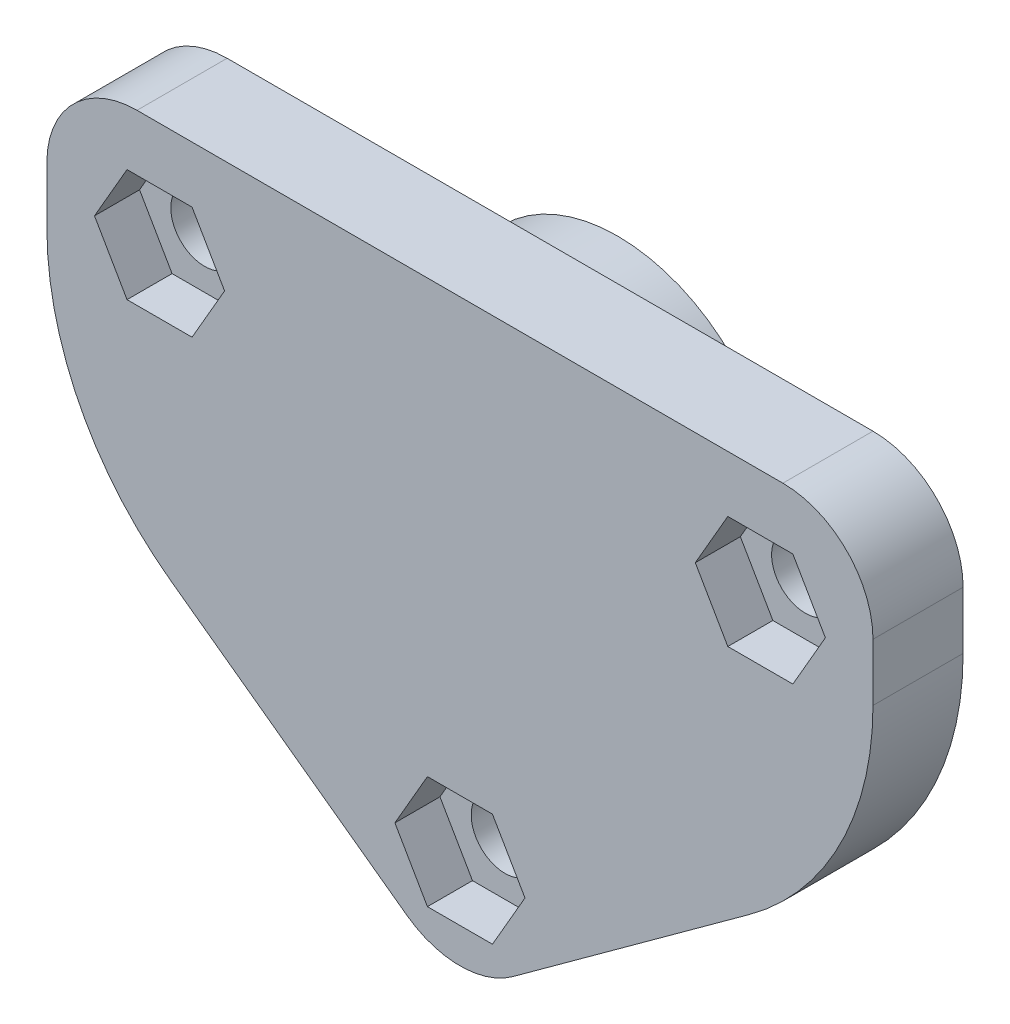
ISO-10303-21;
HEADER;
FILE_DESCRIPTION(('STEP AP214'),'2;1');
FILE_NAME('part.step','',(''),(''),'','','');
FILE_SCHEMA(('AUTOMOTIVE_DESIGN { 1 0 10303 214 1 1 1 1 }'));
ENDSEC;
DATA;
#1=APPLICATION_CONTEXT('core data for automotive mechanical design processes');
#2=APPLICATION_PROTOCOL_DEFINITION('international standard','automotive_design',2000,#1);
#3=PRODUCT_CONTEXT('',#1,'mechanical');
#4=PRODUCT('Part','Part','',(#3));
#5=PRODUCT_RELATED_PRODUCT_CATEGORY('part','',(#4));
#6=PRODUCT_DEFINITION_FORMATION('','',#4);
#7=PRODUCT_DEFINITION_CONTEXT('part definition',#1,'design');
#8=PRODUCT_DEFINITION('design','',#6,#7);
#9=PRODUCT_DEFINITION_SHAPE('','',#8);
#10=(LENGTH_UNIT() NAMED_UNIT(*) SI_UNIT(.MILLI.,.METRE.));
#11=(NAMED_UNIT(*) PLANE_ANGLE_UNIT() SI_UNIT($,.RADIAN.));
#12=(NAMED_UNIT(*) SI_UNIT($,.STERADIAN.) SOLID_ANGLE_UNIT());
#13=UNCERTAINTY_MEASURE_WITH_UNIT(LENGTH_MEASURE(1.E-05),#10,'distance_accuracy_value','');
#14=(GEOMETRIC_REPRESENTATION_CONTEXT(3) GLOBAL_UNCERTAINTY_ASSIGNED_CONTEXT((#13)) GLOBAL_UNIT_ASSIGNED_CONTEXT((#10,
#11,#12)) REPRESENTATION_CONTEXT('',''));
#15=CARTESIAN_POINT('',(0.,0.,0.));
#16=DIRECTION('',(0.,0.,1.));
#17=DIRECTION('',(1.,0.,0.));
#18=AXIS2_PLACEMENT_3D('',#15,#16,#17);
#19=CARTESIAN_POINT('',(-27.5,7.5,6.));
#20=DIRECTION('',(0.,0.,-1.));
#21=DIRECTION('',(-1.,0.,0.));
#22=AXIS2_PLACEMENT_3D('',#19,#20,#21);
#23=CYLINDRICAL_SURFACE('',#22,2.25);
#24=CARTESIAN_POINT('',(-27.5,7.5,0.));
#25=DIRECTION('',(0.,0.,1.));
#26=DIRECTION('',(1.,0.,0.));
#27=AXIS2_PLACEMENT_3D('',#24,#25,#26);
#28=CIRCLE('',#27,2.25);
#29=CARTESIAN_POINT('',(-25.25,7.5,0.));
#30=VERTEX_POINT('',#29);
#31=EDGE_CURVE('E373',#30,#30,#28,.T.);
#32=ORIENTED_EDGE('',*,*,#31,.F.);
#33=EDGE_LOOP('',(#32));
#34=FACE_BOUND('',#33,.T.);
#35=CARTESIAN_POINT('',(-27.5,7.5,3.));
#36=DIRECTION('',(0.,0.,1.));
#37=DIRECTION('',(1.,0.,0.));
#38=AXIS2_PLACEMENT_3D('',#35,#36,#37);
#39=CIRCLE('',#38,2.25);
#40=CARTESIAN_POINT('',(-25.25,7.5,3.));
#41=VERTEX_POINT('',#40);
#42=EDGE_CURVE('E37',#41,#41,#39,.T.);
#43=ORIENTED_EDGE('',*,*,#42,.T.);
#44=EDGE_LOOP('',(#43));
#45=FACE_BOUND('',#44,.T.);
#46=ADVANCED_FACE('F33',(#34,#45),#23,.F.);
#47=CARTESIAN_POINT('',(-7.5,32.5,6.));
#48=DIRECTION('',(0.,0.,-1.));
#49=DIRECTION('',(-1.,0.,0.));
#50=AXIS2_PLACEMENT_3D('',#47,#48,#49);
#51=CYLINDRICAL_SURFACE('',#50,2.25);
#52=CARTESIAN_POINT('',(-7.5,32.5,0.));
#53=DIRECTION('',(0.,0.,1.));
#54=DIRECTION('',(1.,0.,0.));
#55=AXIS2_PLACEMENT_3D('',#52,#53,#54);
#56=CIRCLE('',#55,2.25);
#57=CARTESIAN_POINT('',(-5.25,32.5,0.));
#58=VERTEX_POINT('',#57);
#59=EDGE_CURVE('E377',#58,#58,#56,.T.);
#60=ORIENTED_EDGE('',*,*,#59,.F.);
#61=EDGE_LOOP('',(#60));
#62=FACE_BOUND('',#61,.T.);
#63=CARTESIAN_POINT('',(-7.5,32.5,3.));
#64=DIRECTION('',(0.,0.,1.));
#65=DIRECTION('',(1.,0.,0.));
#66=AXIS2_PLACEMENT_3D('',#63,#64,#65);
#67=CIRCLE('',#66,2.25);
#68=CARTESIAN_POINT('',(-5.25,32.5,3.));
#69=VERTEX_POINT('',#68);
#70=EDGE_CURVE('E311',#69,#69,#67,.T.);
#71=ORIENTED_EDGE('',*,*,#70,.T.);
#72=EDGE_LOOP('',(#71));
#73=FACE_BOUND('',#72,.T.);
#74=ADVANCED_FACE('F463',(#62,#73),#51,.F.);
#75=CARTESIAN_POINT('',(-47.5,32.5,6.));
#76=DIRECTION('',(0.,0.,-1.));
#77=DIRECTION('',(-1.,0.,0.));
#78=AXIS2_PLACEMENT_3D('',#75,#76,#77);
#79=CYLINDRICAL_SURFACE('',#78,2.25);
#80=CARTESIAN_POINT('',(-47.5,32.5,0.));
#81=DIRECTION('',(0.,0.,1.));
#82=DIRECTION('',(1.,0.,0.));
#83=AXIS2_PLACEMENT_3D('',#80,#81,#82);
#84=CIRCLE('',#83,2.25);
#85=CARTESIAN_POINT('',(-45.25,32.5,0.));
#86=VERTEX_POINT('',#85);
#87=EDGE_CURVE('E380',#86,#86,#84,.T.);
#88=ORIENTED_EDGE('',*,*,#87,.F.);
#89=EDGE_LOOP('',(#88));
#90=FACE_BOUND('',#89,.T.);
#91=CARTESIAN_POINT('',(-47.5,32.5,3.));
#92=DIRECTION('',(0.,0.,1.));
#93=DIRECTION('',(1.,0.,0.));
#94=AXIS2_PLACEMENT_3D('',#91,#92,#93);
#95=CIRCLE('',#94,2.25);
#96=CARTESIAN_POINT('',(-45.25,32.5,3.));
#97=VERTEX_POINT('',#96);
#98=EDGE_CURVE('E359',#97,#97,#95,.T.);
#99=ORIENTED_EDGE('',*,*,#98,.T.);
#100=EDGE_LOOP('',(#99));
#101=FACE_BOUND('',#100,.T.);
#102=ADVANCED_FACE('F496',(#90,#101),#79,.F.);
#103=CARTESIAN_POINT('',(0.,0.,6.));
#104=DIRECTION('',(0.,0.,1.));
#105=DIRECTION('',(1.,0.,0.));
#106=AXIS2_PLACEMENT_3D('',#103,#104,#105);
#107=PLANE('',#106);
#108=DIRECTION('',(0.5,0.866025403784439,0.));
#109=VECTOR('',#108,1.);
#110=CARTESIAN_POINT('',(-25.3349364905389,3.75,6.));
#111=LINE('',#110,#109);
#112=CARTESIAN_POINT('',(-25.3349364905389,3.75,6.));
#113=VERTEX_POINT('',#112);
#114=CARTESIAN_POINT('',(-23.1698729810778,7.5,6.));
#115=VERTEX_POINT('',#114);
#116=EDGE_CURVE('E50',#113,#115,#111,.T.);
#117=ORIENTED_EDGE('',*,*,#116,.F.);
#118=DIRECTION('',(1.,0.,0.));
#119=VECTOR('',#118,1.);
#120=CARTESIAN_POINT('',(-29.6650635094611,3.75,6.));
#121=LINE('',#120,#119);
#122=CARTESIAN_POINT('',(-29.6650635094611,3.75,6.));
#123=VERTEX_POINT('',#122);
#124=EDGE_CURVE('E241',#123,#113,#121,.T.);
#125=ORIENTED_EDGE('',*,*,#124,.F.);
#126=DIRECTION('',(0.5,-0.866025403784438,0.));
#127=VECTOR('',#126,1.);
#128=CARTESIAN_POINT('',(-31.8301270189222,7.5,6.));
#129=LINE('',#128,#127);
#130=CARTESIAN_POINT('',(-31.8301270189222,7.5,6.));
#131=VERTEX_POINT('',#130);
#132=EDGE_CURVE('E244',#131,#123,#129,.T.);
#133=ORIENTED_EDGE('',*,*,#132,.F.);
#134=DIRECTION('',(-0.5,-0.866025403784438,0.));
#135=VECTOR('',#134,1.);
#136=CARTESIAN_POINT('',(-29.6650635094611,11.25,6.));
#137=LINE('',#136,#135);
#138=CARTESIAN_POINT('',(-29.6650635094611,11.25,6.));
#139=VERTEX_POINT('',#138);
#140=EDGE_CURVE('E260',#139,#131,#137,.T.);
#141=ORIENTED_EDGE('',*,*,#140,.F.);
#142=DIRECTION('',(-1.,0.,0.));
#143=VECTOR('',#142,1.);
#144=CARTESIAN_POINT('',(-25.3349364905389,11.25,6.));
#145=LINE('',#144,#143);
#146=CARTESIAN_POINT('',(-25.3349364905389,11.25,6.));
#147=VERTEX_POINT('',#146);
#148=EDGE_CURVE('E257',#147,#139,#145,.T.);
#149=ORIENTED_EDGE('',*,*,#148,.F.);
#150=DIRECTION('',(-0.5,0.866025403784439,0.));
#151=VECTOR('',#150,1.);
#152=CARTESIAN_POINT('',(-23.1698729810778,7.5,6.));
#153=LINE('',#152,#151);
#154=EDGE_CURVE('E255',#115,#147,#153,.T.);
#155=ORIENTED_EDGE('',*,*,#154,.F.);
#156=EDGE_LOOP('',(#117,#125,#133,#141,#149,#155));
#157=FACE_BOUND('',#156,.T.);
#158=DIRECTION('',(-0.5,-0.866025403784439,0.));
#159=VECTOR('',#158,1.);
#160=CARTESIAN_POINT('',(-9.6650635094611,36.25,6.));
#161=LINE('',#160,#159);
#162=CARTESIAN_POINT('',(-9.6650635094611,36.25,6.));
#163=VERTEX_POINT('',#162);
#164=CARTESIAN_POINT('',(-11.8301270189222,32.5,6.));
#165=VERTEX_POINT('',#164);
#166=EDGE_CURVE('E58',#163,#165,#161,.T.);
#167=ORIENTED_EDGE('',*,*,#166,.F.);
#168=DIRECTION('',(-1.,0.,0.));
#169=VECTOR('',#168,1.);
#170=CARTESIAN_POINT('',(-5.3349364905389,36.25,6.));
#171=LINE('',#170,#169);
#172=CARTESIAN_POINT('',(-5.3349364905389,36.25,6.));
#173=VERTEX_POINT('',#172);
#174=EDGE_CURVE('E278',#173,#163,#171,.T.);
#175=ORIENTED_EDGE('',*,*,#174,.F.);
#176=DIRECTION('',(-0.5,0.866025403784439,0.));
#177=VECTOR('',#176,1.);
#178=CARTESIAN_POINT('',(-3.16987298107781,32.5,6.));
#179=LINE('',#178,#177);
#180=CARTESIAN_POINT('',(-3.16987298107781,32.5,6.));
#181=VERTEX_POINT('',#180);
#182=EDGE_CURVE('E304',#181,#173,#179,.T.);
#183=ORIENTED_EDGE('',*,*,#182,.F.);
#184=DIRECTION('',(0.5,0.866025403784438,0.));
#185=VECTOR('',#184,1.);
#186=CARTESIAN_POINT('',(-5.33493649053891,28.75,6.));
#187=LINE('',#186,#185);
#188=CARTESIAN_POINT('',(-5.33493649053891,28.75,6.));
#189=VERTEX_POINT('',#188);
#190=EDGE_CURVE('E301',#189,#181,#187,.T.);
#191=ORIENTED_EDGE('',*,*,#190,.F.);
#192=DIRECTION('',(1.,0.,0.));
#193=VECTOR('',#192,1.);
#194=CARTESIAN_POINT('',(-9.6650635094611,28.75,6.));
#195=LINE('',#194,#193);
#196=CARTESIAN_POINT('',(-9.6650635094611,28.75,6.));
#197=VERTEX_POINT('',#196);
#198=EDGE_CURVE('E298',#197,#189,#195,.T.);
#199=ORIENTED_EDGE('',*,*,#198,.F.);
#200=DIRECTION('',(0.5,-0.866025403784439,0.));
#201=VECTOR('',#200,1.);
#202=CARTESIAN_POINT('',(-11.8301270189222,32.5,6.));
#203=LINE('',#202,#201);
#204=EDGE_CURVE('E295',#165,#197,#203,.T.);
#205=ORIENTED_EDGE('',*,*,#204,.F.);
#206=EDGE_LOOP('',(#167,#175,#183,#191,#199,#205));
#207=FACE_BOUND('',#206,.T.);
#208=DIRECTION('',(0.5,0.866025403784439,0.));
#209=VECTOR('',#208,1.);
#210=CARTESIAN_POINT('',(-45.3349364905389,28.75,6.));
#211=LINE('',#210,#209);
#212=CARTESIAN_POINT('',(-45.3349364905389,28.75,6.));
#213=VERTEX_POINT('',#212);
#214=CARTESIAN_POINT('',(-43.1698729810778,32.5,6.));
#215=VERTEX_POINT('',#214);
#216=EDGE_CURVE('E341',#213,#215,#211,.T.);
#217=ORIENTED_EDGE('',*,*,#216,.F.);
#218=DIRECTION('',(1.,0.,0.));
#219=VECTOR('',#218,1.);
#220=CARTESIAN_POINT('',(-49.6650635094611,28.75,6.));
#221=LINE('',#220,#219);
#222=CARTESIAN_POINT('',(-49.6650635094611,28.75,6.));
#223=VERTEX_POINT('',#222);
#224=EDGE_CURVE('E325',#223,#213,#221,.T.);
#225=ORIENTED_EDGE('',*,*,#224,.F.);
#226=DIRECTION('',(0.5,-0.866025403784439,0.));
#227=VECTOR('',#226,1.);
#228=CARTESIAN_POINT('',(-51.8301270189222,32.5,6.));
#229=LINE('',#228,#227);
#230=CARTESIAN_POINT('',(-51.8301270189222,32.5,6.));
#231=VERTEX_POINT('',#230);
#232=EDGE_CURVE('E352',#231,#223,#229,.T.);
#233=ORIENTED_EDGE('',*,*,#232,.F.);
#234=DIRECTION('',(-0.500000000000001,-0.866025403784438,0.));
#235=VECTOR('',#234,1.);
#236=CARTESIAN_POINT('',(-49.6650635094611,36.25,6.));
#237=LINE('',#236,#235);
#238=CARTESIAN_POINT('',(-49.6650635094611,36.25,6.));
#239=VERTEX_POINT('',#238);
#240=EDGE_CURVE('E349',#239,#231,#237,.T.);
#241=ORIENTED_EDGE('',*,*,#240,.F.);
#242=DIRECTION('',(-1.,0.,0.));
#243=VECTOR('',#242,1.);
#244=CARTESIAN_POINT('',(-45.3349364905389,36.25,6.));
#245=LINE('',#244,#243);
#246=CARTESIAN_POINT('',(-45.3349364905389,36.25,6.));
#247=VERTEX_POINT('',#246);
#248=EDGE_CURVE('E346',#247,#239,#245,.T.);
#249=ORIENTED_EDGE('',*,*,#248,.F.);
#250=DIRECTION('',(-0.5,0.866025403784439,0.));
#251=VECTOR('',#250,1.);
#252=CARTESIAN_POINT('',(-43.1698729810778,32.5,6.));
#253=LINE('',#252,#251);
#254=EDGE_CURVE('E343',#215,#247,#253,.T.);
#255=ORIENTED_EDGE('',*,*,#254,.F.);
#256=EDGE_LOOP('',(#217,#225,#233,#241,#249,#255));
#257=FACE_BOUND('',#256,.T.);
#258=DIRECTION('',(0.,-1.,0.));
#259=VECTOR('',#258,1.);
#260=CARTESIAN_POINT('',(-55.,40.,6.));
#261=LINE('',#260,#259);
#262=CARTESIAN_POINT('',(-55.,34.,6.));
#263=VERTEX_POINT('',#262);
#264=CARTESIAN_POINT('',(-55.,30.1844918340644,6.));
#265=VERTEX_POINT('',#264);
#266=EDGE_CURVE('E384',#263,#265,#261,.T.);
#267=ORIENTED_EDGE('',*,*,#266,.T.);
#268=CARTESIAN_POINT('',(-35.,30.1844918340644,6.));
#269=DIRECTION('',(0.,0.,1.));
#270=DIRECTION('',(1.,0.,0.));
#271=AXIS2_PLACEMENT_3D('',#268,#269,#270);
#272=CIRCLE('',#271,20.);
#273=CARTESIAN_POINT('',(-46.7634339535009,14.0097701480007,6.));
#274=VERTEX_POINT('',#273);
#275=EDGE_CURVE('E451',#265,#274,#272,.T.);
#276=ORIENTED_EDGE('',*,*,#275,.T.);
#277=DIRECTION('',(0.808736084303188,-0.588171697675046,0.));
#278=VECTOR('',#277,1.);
#279=CARTESIAN_POINT('',(-55.,20.,6.));
#280=LINE('',#279,#278);
#281=CARTESIAN_POINT('',(-31.0290301860503,2.56656740803657,6.));
#282=VERTEX_POINT('',#281);
#283=EDGE_CURVE('E387',#274,#282,#280,.T.);
#284=ORIENTED_EDGE('',*,*,#283,.T.);
#285=CARTESIAN_POINT('',(-27.5,7.4189839138557,6.));
#286=DIRECTION('',(0.,0.,1.));
#287=DIRECTION('',(1.,0.,0.));
#288=AXIS2_PLACEMENT_3D('',#285,#286,#287);
#289=CIRCLE('',#288,6.);
#290=CARTESIAN_POINT('',(-23.9709698139497,2.56656740803657,6.));
#291=VERTEX_POINT('',#290);
#292=EDGE_CURVE('E427',#282,#291,#289,.T.);
#293=ORIENTED_EDGE('',*,*,#292,.T.);
#294=DIRECTION('',(0.808736084303188,0.588171697675046,0.));
#295=VECTOR('',#294,1.);
#296=CARTESIAN_POINT('',(-27.5,0.,6.));
#297=LINE('',#296,#295);
#298=CARTESIAN_POINT('',(-8.23656604649908,14.0097701480007,6.));
#299=VERTEX_POINT('',#298);
#300=EDGE_CURVE('E390',#291,#299,#297,.T.);
#301=ORIENTED_EDGE('',*,*,#300,.T.);
#302=CARTESIAN_POINT('',(-20.,30.1844918340644,6.));
#303=DIRECTION('',(0.,0.,1.));
#304=DIRECTION('',(1.,0.,0.));
#305=AXIS2_PLACEMENT_3D('',#302,#303,#304);
#306=CIRCLE('',#305,20.);
#307=CARTESIAN_POINT('',(0.,30.1844918340644,6.));
#308=VERTEX_POINT('',#307);
#309=EDGE_CURVE('E449',#299,#308,#306,.T.);
#310=ORIENTED_EDGE('',*,*,#309,.T.);
#311=DIRECTION('',(0.,1.,0.));
#312=VECTOR('',#311,1.);
#313=CARTESIAN_POINT('',(0.,40.,6.));
#314=LINE('',#313,#312);
#315=CARTESIAN_POINT('',(0.,34.,6.));
#316=VERTEX_POINT('',#315);
#317=EDGE_CURVE('E393',#308,#316,#314,.T.);
#318=ORIENTED_EDGE('',*,*,#317,.T.);
#319=CARTESIAN_POINT('',(-6.,34.,6.));
#320=DIRECTION('',(0.,0.,1.));
#321=DIRECTION('',(1.,0.,0.));
#322=AXIS2_PLACEMENT_3D('',#319,#320,#321);
#323=CIRCLE('',#322,6.);
#324=CARTESIAN_POINT('',(-6.,40.,6.));
#325=VERTEX_POINT('',#324);
#326=EDGE_CURVE('E423',#316,#325,#323,.T.);
#327=ORIENTED_EDGE('',*,*,#326,.T.);
#328=DIRECTION('',(-1.,0.,0.));
#329=VECTOR('',#328,1.);
#330=CARTESIAN_POINT('',(-55.,40.,6.));
#331=LINE('',#330,#329);
#332=CARTESIAN_POINT('',(-49.,40.,6.));
#333=VERTEX_POINT('',#332);
#334=EDGE_CURVE('E395',#325,#333,#331,.T.);
#335=ORIENTED_EDGE('',*,*,#334,.T.);
#336=CARTESIAN_POINT('',(-49.,34.,6.));
#337=DIRECTION('',(0.,0.,1.));
#338=DIRECTION('',(1.,0.,0.));
#339=AXIS2_PLACEMENT_3D('',#336,#337,#338);
#340=CIRCLE('',#339,6.);
#341=EDGE_CURVE('E425',#333,#263,#340,.T.);
#342=ORIENTED_EDGE('',*,*,#341,.T.);
#343=EDGE_LOOP('',(#267,#276,#284,#293,#301,#310,#318,#327,#335,#342));
#344=FACE_BOUND('',#343,.T.);
#345=ADVANCED_FACE('F492',(#157,#207,#257,#344),#107,.T.);
#346=CARTESIAN_POINT('',(0.,0.,0.));
#347=DIRECTION('',(0.,0.,1.));
#348=DIRECTION('',(1.,0.,0.));
#349=AXIS2_PLACEMENT_3D('',#346,#347,#348);
#350=PLANE('',#349);
#351=CARTESIAN_POINT('',(-27.5,27.5,0.));
#352=DIRECTION('',(0.,0.,1.));
#353=DIRECTION('',(1.,0.,0.));
#354=AXIS2_PLACEMENT_3D('',#351,#352,#353);
#355=CIRCLE('',#354,10.75);
#356=CARTESIAN_POINT('',(-16.75,27.5,0.));
#357=VERTEX_POINT('',#356);
#358=EDGE_CURVE('E11',#357,#357,#355,.F.);
#359=ORIENTED_EDGE('',*,*,#358,.F.);
#360=EDGE_LOOP('',(#359));
#361=FACE_BOUND('',#360,.T.);
#362=DIRECTION('',(0.808736084303188,-0.588171697675046,0.));
#363=VECTOR('',#362,1.);
#364=CARTESIAN_POINT('',(-55.,20.,0.));
#365=LINE('',#364,#363);
#366=CARTESIAN_POINT('',(-46.7634339535009,14.0097701480007,0.));
#367=VERTEX_POINT('',#366);
#368=CARTESIAN_POINT('',(-31.0290301860503,2.56656740803657,0.));
#369=VERTEX_POINT('',#368);
#370=EDGE_CURVE('E401',#367,#369,#365,.T.);
#371=ORIENTED_EDGE('',*,*,#370,.F.);
#372=CARTESIAN_POINT('',(-35.,30.1844918340644,0.));
#373=DIRECTION('',(0.,0.,1.));
#374=DIRECTION('',(1.,0.,0.));
#375=AXIS2_PLACEMENT_3D('',#372,#373,#374);
#376=CIRCLE('',#375,20.);
#377=CARTESIAN_POINT('',(-55.,30.1844918340644,0.));
#378=VERTEX_POINT('',#377);
#379=EDGE_CURVE('E445',#367,#378,#376,.F.);
#380=ORIENTED_EDGE('',*,*,#379,.T.);
#381=DIRECTION('',(0.,-1.,0.));
#382=VECTOR('',#381,1.);
#383=CARTESIAN_POINT('',(-55.,40.,0.));
#384=LINE('',#383,#382);
#385=CARTESIAN_POINT('',(-55.,34.,0.));
#386=VERTEX_POINT('',#385);
#387=EDGE_CURVE('E383',#386,#378,#384,.T.);
#388=ORIENTED_EDGE('',*,*,#387,.F.);
#389=CARTESIAN_POINT('',(-49.,34.,0.));
#390=DIRECTION('',(0.,0.,1.));
#391=DIRECTION('',(1.,0.,0.));
#392=AXIS2_PLACEMENT_3D('',#389,#390,#391);
#393=CIRCLE('',#392,6.);
#394=CARTESIAN_POINT('',(-49.,40.,0.));
#395=VERTEX_POINT('',#394);
#396=EDGE_CURVE('E415',#386,#395,#393,.F.);
#397=ORIENTED_EDGE('',*,*,#396,.T.);
#398=DIRECTION('',(-1.,0.,0.));
#399=VECTOR('',#398,1.);
#400=CARTESIAN_POINT('',(-55.,40.,0.));
#401=LINE('',#400,#399);
#402=CARTESIAN_POINT('',(-6.,40.,0.));
#403=VERTEX_POINT('',#402);
#404=EDGE_CURVE('E388',#403,#395,#401,.T.);
#405=ORIENTED_EDGE('',*,*,#404,.F.);
#406=CARTESIAN_POINT('',(-6.,34.,0.));
#407=DIRECTION('',(0.,0.,1.));
#408=DIRECTION('',(1.,0.,0.));
#409=AXIS2_PLACEMENT_3D('',#406,#407,#408);
#410=CIRCLE('',#409,6.);
#411=CARTESIAN_POINT('',(0.,34.,0.));
#412=VERTEX_POINT('',#411);
#413=EDGE_CURVE('E412',#403,#412,#410,.F.);
#414=ORIENTED_EDGE('',*,*,#413,.T.);
#415=DIRECTION('',(0.,1.,0.));
#416=VECTOR('',#415,1.);
#417=CARTESIAN_POINT('',(0.,40.,0.));
#418=LINE('',#417,#416);
#419=CARTESIAN_POINT('',(0.,30.1844918340644,0.));
#420=VERTEX_POINT('',#419);
#421=EDGE_CURVE('E406',#420,#412,#418,.T.);
#422=ORIENTED_EDGE('',*,*,#421,.F.);
#423=CARTESIAN_POINT('',(-20.,30.1844918340644,0.));
#424=DIRECTION('',(0.,0.,1.));
#425=DIRECTION('',(1.,0.,0.));
#426=AXIS2_PLACEMENT_3D('',#423,#424,#425);
#427=CIRCLE('',#426,20.);
#428=CARTESIAN_POINT('',(-8.23656604649908,14.0097701480007,0.));
#429=VERTEX_POINT('',#428);
#430=EDGE_CURVE('E443',#420,#429,#427,.F.);
#431=ORIENTED_EDGE('',*,*,#430,.T.);
#432=DIRECTION('',(0.808736084303188,0.588171697675046,0.));
#433=VECTOR('',#432,1.);
#434=CARTESIAN_POINT('',(-27.5,0.,0.));
#435=LINE('',#434,#433);
#436=CARTESIAN_POINT('',(-23.9709698139497,2.56656740803657,0.));
#437=VERTEX_POINT('',#436);
#438=EDGE_CURVE('E403',#437,#429,#435,.T.);
#439=ORIENTED_EDGE('',*,*,#438,.F.);
#440=CARTESIAN_POINT('',(-27.5,7.4189839138557,0.));
#441=DIRECTION('',(0.,0.,1.));
#442=DIRECTION('',(1.,0.,0.));
#443=AXIS2_PLACEMENT_3D('',#440,#441,#442);
#444=CIRCLE('',#443,6.);
#445=EDGE_CURVE('E417',#437,#369,#444,.F.);
#446=ORIENTED_EDGE('',*,*,#445,.T.);
#447=EDGE_LOOP('',(#371,#380,#388,#397,#405,#414,#422,#431,#439,#446));
#448=FACE_BOUND('',#447,.T.);
#449=ORIENTED_EDGE('',*,*,#87,.T.);
#450=EDGE_LOOP('',(#449));
#451=FACE_BOUND('',#450,.T.);
#452=ORIENTED_EDGE('',*,*,#59,.T.);
#453=EDGE_LOOP('',(#452));
#454=FACE_BOUND('',#453,.T.);
#455=ORIENTED_EDGE('',*,*,#31,.T.);
#456=EDGE_LOOP('',(#455));
#457=FACE_BOUND('',#456,.T.);
#458=ADVANCED_FACE('F495',(#361,#448,#451,#454,#457),#350,.F.);
#459=CARTESIAN_POINT('',(-55.,40.,6.));
#460=DIRECTION('',(1.,0.,0.));
#461=DIRECTION('',(0.,1.,0.));
#462=AXIS2_PLACEMENT_3D('',#459,#460,#461);
#463=PLANE('',#462);
#464=ORIENTED_EDGE('',*,*,#387,.T.);
#465=DIRECTION('',(0.,0.,-1.));
#466=VECTOR('',#465,1.);
#467=CARTESIAN_POINT('',(-55.,30.1844918340644,6.));
#468=LINE('',#467,#466);
#469=EDGE_CURVE('E447',#378,#265,#468,.F.);
#470=ORIENTED_EDGE('',*,*,#469,.T.);
#471=ORIENTED_EDGE('',*,*,#266,.F.);
#472=DIRECTION('',(0.,0.,-1.));
#473=VECTOR('',#472,1.);
#474=CARTESIAN_POINT('',(-55.,34.,6.));
#475=LINE('',#474,#473);
#476=EDGE_CURVE('E429',#263,#386,#475,.T.);
#477=ORIENTED_EDGE('',*,*,#476,.T.);
#478=EDGE_LOOP('',(#464,#470,#471,#477));
#479=FACE_BOUND('',#478,.T.);
#480=ADVANCED_FACE('F548',(#479),#463,.F.);
#481=CARTESIAN_POINT('',(-55.,20.,6.));
#482=DIRECTION('',(0.588171697675046,0.808736084303189,0.));
#483=DIRECTION('',(-0.808736084303189,0.588171697675046,0.));
#484=AXIS2_PLACEMENT_3D('',#481,#482,#483);
#485=PLANE('',#484);
#486=ORIENTED_EDGE('',*,*,#283,.F.);
#487=DIRECTION('',(0.,0.,-1.));
#488=VECTOR('',#487,1.);
#489=CARTESIAN_POINT('',(-46.7634339535009,14.0097701480007,6.));
#490=LINE('',#489,#488);
#491=EDGE_CURVE('E440',#274,#367,#490,.T.);
#492=ORIENTED_EDGE('',*,*,#491,.T.);
#493=ORIENTED_EDGE('',*,*,#370,.T.);
#494=DIRECTION('',(0.,0.,-1.));
#495=VECTOR('',#494,1.);
#496=CARTESIAN_POINT('',(-31.0290301860503,2.56656740803657,6.));
#497=LINE('',#496,#495);
#498=EDGE_CURVE('E420',#369,#282,#497,.F.);
#499=ORIENTED_EDGE('',*,*,#498,.T.);
#500=EDGE_LOOP('',(#486,#492,#493,#499));
#501=FACE_BOUND('',#500,.T.);
#502=ADVANCED_FACE('F515',(#501),#485,.F.);
#503=CARTESIAN_POINT('',(-27.5,0.,6.));
#504=DIRECTION('',(-0.588171697675046,0.808736084303189,0.));
#505=DIRECTION('',(-0.808736084303189,-0.588171697675046,0.));
#506=AXIS2_PLACEMENT_3D('',#503,#504,#505);
#507=PLANE('',#506);
#508=ORIENTED_EDGE('',*,*,#438,.T.);
#509=DIRECTION('',(0.,0.,-1.));
#510=VECTOR('',#509,1.);
#511=CARTESIAN_POINT('',(-8.23656604649908,14.0097701480007,6.));
#512=LINE('',#511,#510);
#513=EDGE_CURVE('E42',#429,#299,#512,.F.);
#514=ORIENTED_EDGE('',*,*,#513,.T.);
#515=ORIENTED_EDGE('',*,*,#300,.F.);
#516=DIRECTION('',(0.,0.,-1.));
#517=VECTOR('',#516,1.);
#518=CARTESIAN_POINT('',(-23.9709698139497,2.56656740803657,6.));
#519=LINE('',#518,#517);
#520=EDGE_CURVE('E398',#291,#437,#519,.T.);
#521=ORIENTED_EDGE('',*,*,#520,.T.);
#522=EDGE_LOOP('',(#508,#514,#515,#521));
#523=FACE_BOUND('',#522,.T.);
#524=ADVANCED_FACE('F528',(#523),#507,.F.);
#525=CARTESIAN_POINT('',(0.,40.,6.));
#526=DIRECTION('',(-1.,0.,0.));
#527=DIRECTION('',(0.,0.,1.));
#528=AXIS2_PLACEMENT_3D('',#525,#526,#527);
#529=PLANE('',#528);
#530=ORIENTED_EDGE('',*,*,#317,.F.);
#531=DIRECTION('',(0.,0.,-1.));
#532=VECTOR('',#531,1.);
#533=CARTESIAN_POINT('',(0.,30.1844918340644,6.));
#534=LINE('',#533,#532);
#535=EDGE_CURVE('E453',#308,#420,#534,.T.);
#536=ORIENTED_EDGE('',*,*,#535,.T.);
#537=ORIENTED_EDGE('',*,*,#421,.T.);
#538=DIRECTION('',(0.,0.,-1.));
#539=VECTOR('',#538,1.);
#540=CARTESIAN_POINT('',(0.,34.,6.));
#541=LINE('',#540,#539);
#542=EDGE_CURVE('E437',#412,#316,#541,.F.);
#543=ORIENTED_EDGE('',*,*,#542,.T.);
#544=EDGE_LOOP('',(#530,#536,#537,#543));
#545=FACE_BOUND('',#544,.T.);
#546=ADVANCED_FACE('F534',(#545),#529,.F.);
#547=CARTESIAN_POINT('',(-55.,40.,6.));
#548=DIRECTION('',(0.,-1.,0.));
#549=DIRECTION('',(0.,0.,-1.));
#550=AXIS2_PLACEMENT_3D('',#547,#548,#549);
#551=PLANE('',#550);
#552=ORIENTED_EDGE('',*,*,#404,.T.);
#553=DIRECTION('',(0.,0.,-1.));
#554=VECTOR('',#553,1.);
#555=CARTESIAN_POINT('',(-49.,40.,6.));
#556=LINE('',#555,#554);
#557=EDGE_CURVE('E435',#395,#333,#556,.F.);
#558=ORIENTED_EDGE('',*,*,#557,.T.);
#559=ORIENTED_EDGE('',*,*,#334,.F.);
#560=DIRECTION('',(0.,0.,-1.));
#561=VECTOR('',#560,1.);
#562=CARTESIAN_POINT('',(-6.,40.,6.));
#563=LINE('',#562,#561);
#564=EDGE_CURVE('E432',#325,#403,#563,.T.);
#565=ORIENTED_EDGE('',*,*,#564,.T.);
#566=EDGE_LOOP('',(#552,#558,#559,#565));
#567=FACE_BOUND('',#566,.T.);
#568=ADVANCED_FACE('F543',(#567),#551,.F.);
#569=CARTESIAN_POINT('',(-27.5,7.4189839138557,6.));
#570=DIRECTION('',(0.,0.,-1.));
#571=DIRECTION('',(-1.,0.,0.));
#572=AXIS2_PLACEMENT_3D('',#569,#570,#571);
#573=CYLINDRICAL_SURFACE('',#572,6.);
#574=ORIENTED_EDGE('',*,*,#292,.F.);
#575=ORIENTED_EDGE('',*,*,#498,.F.);
#576=ORIENTED_EDGE('',*,*,#445,.F.);
#577=ORIENTED_EDGE('',*,*,#520,.F.);
#578=EDGE_LOOP('',(#574,#575,#576,#577));
#579=FACE_BOUND('',#578,.T.);
#580=ADVANCED_FACE('F524',(#579),#573,.T.);
#581=CARTESIAN_POINT('',(-49.,34.,6.));
#582=DIRECTION('',(0.,0.,-1.));
#583=DIRECTION('',(-1.,0.,0.));
#584=AXIS2_PLACEMENT_3D('',#581,#582,#583);
#585=CYLINDRICAL_SURFACE('',#584,6.);
#586=ORIENTED_EDGE('',*,*,#341,.F.);
#587=ORIENTED_EDGE('',*,*,#557,.F.);
#588=ORIENTED_EDGE('',*,*,#396,.F.);
#589=ORIENTED_EDGE('',*,*,#476,.F.);
#590=EDGE_LOOP('',(#586,#587,#588,#589));
#591=FACE_BOUND('',#590,.T.);
#592=ADVANCED_FACE('F547',(#591),#585,.T.);
#593=CARTESIAN_POINT('',(-6.,34.,6.));
#594=DIRECTION('',(0.,0.,-1.));
#595=DIRECTION('',(-1.,0.,0.));
#596=AXIS2_PLACEMENT_3D('',#593,#594,#595);
#597=CYLINDRICAL_SURFACE('',#596,6.);
#598=ORIENTED_EDGE('',*,*,#326,.F.);
#599=ORIENTED_EDGE('',*,*,#542,.F.);
#600=ORIENTED_EDGE('',*,*,#413,.F.);
#601=ORIENTED_EDGE('',*,*,#564,.F.);
#602=EDGE_LOOP('',(#598,#599,#600,#601));
#603=FACE_BOUND('',#602,.T.);
#604=ADVANCED_FACE('F540',(#603),#597,.T.);
#605=CARTESIAN_POINT('',(-35.,30.1844918340644,6.));
#606=DIRECTION('',(0.,0.,-1.));
#607=DIRECTION('',(-1.,0.,0.));
#608=AXIS2_PLACEMENT_3D('',#605,#606,#607);
#609=CYLINDRICAL_SURFACE('',#608,20.);
#610=ORIENTED_EDGE('',*,*,#275,.F.);
#611=ORIENTED_EDGE('',*,*,#469,.F.);
#612=ORIENTED_EDGE('',*,*,#379,.F.);
#613=ORIENTED_EDGE('',*,*,#491,.F.);
#614=EDGE_LOOP('',(#610,#611,#612,#613));
#615=FACE_BOUND('',#614,.T.);
#616=ADVANCED_FACE('F512',(#615),#609,.T.);
#617=CARTESIAN_POINT('',(-20.,30.1844918340644,6.));
#618=DIRECTION('',(0.,0.,-1.));
#619=DIRECTION('',(-1.,0.,0.));
#620=AXIS2_PLACEMENT_3D('',#617,#618,#619);
#621=CYLINDRICAL_SURFACE('',#620,20.);
#622=ORIENTED_EDGE('',*,*,#309,.F.);
#623=ORIENTED_EDGE('',*,*,#513,.F.);
#624=ORIENTED_EDGE('',*,*,#430,.F.);
#625=ORIENTED_EDGE('',*,*,#535,.F.);
#626=EDGE_LOOP('',(#622,#623,#624,#625));
#627=FACE_BOUND('',#626,.T.);
#628=ADVANCED_FACE('F35',(#627),#621,.T.);
#629=CARTESIAN_POINT('',(-27.5,27.5,-4.5));
#630=DIRECTION('',(0.,0.,1.));
#631=DIRECTION('',(1.,0.,0.));
#632=AXIS2_PLACEMENT_3D('',#629,#630,#631);
#633=CYLINDRICAL_SURFACE('',#632,10.75);
#634=CARTESIAN_POINT('',(-27.5,27.5,-4.5));
#635=DIRECTION('',(0.,0.,-1.));
#636=DIRECTION('',(-1.,0.,0.));
#637=AXIS2_PLACEMENT_3D('',#634,#635,#636);
#638=CIRCLE('',#637,10.75);
#639=CARTESIAN_POINT('',(-38.25,27.5,-4.5));
#640=VERTEX_POINT('',#639);
#641=EDGE_CURVE('E370',#640,#640,#638,.T.);
#642=ORIENTED_EDGE('',*,*,#641,.F.);
#643=EDGE_LOOP('',(#642));
#644=FACE_BOUND('',#643,.T.);
#645=ORIENTED_EDGE('',*,*,#358,.T.);
#646=EDGE_LOOP('',(#645));
#647=FACE_BOUND('',#646,.T.);
#648=ADVANCED_FACE('F570',(#644,#647),#633,.T.);
#649=CARTESIAN_POINT('',(-27.5,27.5,-4.5));
#650=DIRECTION('',(0.,0.,-1.));
#651=DIRECTION('',(-1.,0.,0.));
#652=AXIS2_PLACEMENT_3D('',#649,#650,#651);
#653=PLANE('',#652);
#654=CARTESIAN_POINT('',(-27.5,27.5,-4.5));
#655=DIRECTION('',(0.,0.,-1.));
#656=DIRECTION('',(-1.,0.,0.));
#657=AXIS2_PLACEMENT_3D('',#654,#655,#656);
#658=CIRCLE('',#657,2.75);
#659=CARTESIAN_POINT('',(-30.25,27.5,-4.5));
#660=VERTEX_POINT('',#659);
#661=EDGE_CURVE('E374',#660,#660,#658,.T.);
#662=ORIENTED_EDGE('',*,*,#661,.F.);
#663=EDGE_LOOP('',(#662));
#664=FACE_BOUND('',#663,.T.);
#665=ORIENTED_EDGE('',*,*,#641,.T.);
#666=EDGE_LOOP('',(#665));
#667=FACE_BOUND('',#666,.T.);
#668=ADVANCED_FACE('F627',(#664,#667),#653,.T.);
#669=CARTESIAN_POINT('',(-27.5,27.5,-4.5));
#670=DIRECTION('',(0.,1.,0.));
#671=DIRECTION('',(-1.,0.,0.));
#672=AXIS2_PLACEMENT_3D('',#669,#670,#671);
#673=SPHERICAL_SURFACE('',#672,2.75);
#674=CARTESIAN_POINT('',(-27.5,27.5,-4.5));
#675=DIRECTION('',(0.,0.,-1.));
#676=DIRECTION('',(-1.,0.,0.));
#677=AXIS2_PLACEMENT_3D('',#674,#675,#676);
#678=SPHERICAL_SURFACE('',#677,2.75);
#679=ORIENTED_EDGE('',*,*,#661,.T.);
#680=EDGE_LOOP('',(#679));
#681=FACE_BOUND('',#680,.T.);
#682=ADVANCED_FACE('F634',(#681),#678,.F.);
#683=CARTESIAN_POINT('',(-45.3349364905389,28.75,3.));
#684=DIRECTION('',(0.866025403784439,-0.5,0.));
#685=DIRECTION('',(0.5,0.866025403784439,0.));
#686=AXIS2_PLACEMENT_3D('',#683,#684,#685);
#687=PLANE('',#686);
#688=ORIENTED_EDGE('',*,*,#216,.T.);
#689=DIRECTION('',(0.,0.,1.));
#690=VECTOR('',#689,1.);
#691=CARTESIAN_POINT('',(-43.1698729810778,32.5,3.));
#692=LINE('',#691,#690);
#693=CARTESIAN_POINT('',(-43.1698729810778,32.5,3.));
#694=VERTEX_POINT('',#693);
#695=EDGE_CURVE('E340',#694,#215,#692,.T.);
#696=ORIENTED_EDGE('',*,*,#695,.F.);
#697=DIRECTION('',(0.5,0.866025403784439,0.));
#698=VECTOR('',#697,1.);
#699=CARTESIAN_POINT('',(-45.3349364905389,28.75,3.));
#700=LINE('',#699,#698);
#701=CARTESIAN_POINT('',(-45.3349364905389,28.75,3.));
#702=VERTEX_POINT('',#701);
#703=EDGE_CURVE('E321',#702,#694,#700,.T.);
#704=ORIENTED_EDGE('',*,*,#703,.F.);
#705=DIRECTION('',(0.,0.,1.));
#706=VECTOR('',#705,1.);
#707=CARTESIAN_POINT('',(-45.3349364905389,28.75,3.));
#708=LINE('',#707,#706);
#709=EDGE_CURVE('E357',#702,#213,#708,.T.);
#710=ORIENTED_EDGE('',*,*,#709,.T.);
#711=EDGE_LOOP('',(#688,#696,#704,#710));
#712=FACE_BOUND('',#711,.T.);
#713=ADVANCED_FACE('F641',(#712),#687,.F.);
#714=CARTESIAN_POINT('',(-49.6650635094611,28.75,3.));
#715=DIRECTION('',(0.,-1.,0.));
#716=DIRECTION('',(0.,0.,-1.));
#717=AXIS2_PLACEMENT_3D('',#714,#715,#716);
#718=PLANE('',#717);
#719=ORIENTED_EDGE('',*,*,#224,.T.);
#720=ORIENTED_EDGE('',*,*,#709,.F.);
#721=DIRECTION('',(1.,0.,0.));
#722=VECTOR('',#721,1.);
#723=CARTESIAN_POINT('',(-49.6650635094611,28.75,3.));
#724=LINE('',#723,#722);
#725=CARTESIAN_POINT('',(-49.6650635094611,28.75,3.));
#726=VERTEX_POINT('',#725);
#727=EDGE_CURVE('E337',#726,#702,#724,.T.);
#728=ORIENTED_EDGE('',*,*,#727,.F.);
#729=DIRECTION('',(0.,0.,1.));
#730=VECTOR('',#729,1.);
#731=CARTESIAN_POINT('',(-49.6650635094611,28.75,3.));
#732=LINE('',#731,#730);
#733=EDGE_CURVE('E360',#726,#223,#732,.T.);
#734=ORIENTED_EDGE('',*,*,#733,.T.);
#735=EDGE_LOOP('',(#719,#720,#728,#734));
#736=FACE_BOUND('',#735,.T.);
#737=ADVANCED_FACE('F649',(#736),#718,.F.);
#738=CARTESIAN_POINT('',(-51.8301270189222,32.5,3.));
#739=DIRECTION('',(-0.866025403784438,-0.5,0.));
#740=DIRECTION('',(0.5,-0.866025403784439,0.));
#741=AXIS2_PLACEMENT_3D('',#738,#739,#740);
#742=PLANE('',#741);
#743=ORIENTED_EDGE('',*,*,#232,.T.);
#744=ORIENTED_EDGE('',*,*,#733,.F.);
#745=DIRECTION('',(0.5,-0.866025403784439,0.));
#746=VECTOR('',#745,1.);
#747=CARTESIAN_POINT('',(-51.8301270189222,32.5,3.));
#748=LINE('',#747,#746);
#749=CARTESIAN_POINT('',(-51.8301270189222,32.5,3.));
#750=VERTEX_POINT('',#749);
#751=EDGE_CURVE('E334',#750,#726,#748,.T.);
#752=ORIENTED_EDGE('',*,*,#751,.F.);
#753=DIRECTION('',(0.,0.,1.));
#754=VECTOR('',#753,1.);
#755=CARTESIAN_POINT('',(-51.8301270189222,32.5,3.));
#756=LINE('',#755,#754);
#757=EDGE_CURVE('E362',#750,#231,#756,.T.);
#758=ORIENTED_EDGE('',*,*,#757,.T.);
#759=EDGE_LOOP('',(#743,#744,#752,#758));
#760=FACE_BOUND('',#759,.T.);
#761=ADVANCED_FACE('F658',(#760),#742,.F.);
#762=CARTESIAN_POINT('',(-49.6650635094611,36.25,3.));
#763=DIRECTION('',(-0.866025403784438,0.500000000000001,0.));
#764=DIRECTION('',(-0.500000000000001,-0.866025403784438,0.));
#765=AXIS2_PLACEMENT_3D('',#762,#763,#764);
#766=PLANE('',#765);
#767=ORIENTED_EDGE('',*,*,#240,.T.);
#768=ORIENTED_EDGE('',*,*,#757,.F.);
#769=DIRECTION('',(-0.500000000000001,-0.866025403784438,0.));
#770=VECTOR('',#769,1.);
#771=CARTESIAN_POINT('',(-49.6650635094611,36.25,3.));
#772=LINE('',#771,#770);
#773=CARTESIAN_POINT('',(-49.6650635094611,36.25,3.));
#774=VERTEX_POINT('',#773);
#775=EDGE_CURVE('E331',#774,#750,#772,.T.);
#776=ORIENTED_EDGE('',*,*,#775,.F.);
#777=DIRECTION('',(0.,0.,1.));
#778=VECTOR('',#777,1.);
#779=CARTESIAN_POINT('',(-49.6650635094611,36.25,3.));
#780=LINE('',#779,#778);
#781=EDGE_CURVE('E364',#774,#239,#780,.T.);
#782=ORIENTED_EDGE('',*,*,#781,.T.);
#783=EDGE_LOOP('',(#767,#768,#776,#782));
#784=FACE_BOUND('',#783,.T.);
#785=ADVANCED_FACE('F666',(#784),#766,.F.);
#786=CARTESIAN_POINT('',(-45.3349364905389,36.25,3.));
#787=DIRECTION('',(0.,1.,0.));
#788=DIRECTION('',(0.,0.,1.));
#789=AXIS2_PLACEMENT_3D('',#786,#787,#788);
#790=PLANE('',#789);
#791=ORIENTED_EDGE('',*,*,#248,.T.);
#792=ORIENTED_EDGE('',*,*,#781,.F.);
#793=DIRECTION('',(-1.,0.,0.));
#794=VECTOR('',#793,1.);
#795=CARTESIAN_POINT('',(-45.3349364905389,36.25,3.));
#796=LINE('',#795,#794);
#797=CARTESIAN_POINT('',(-45.3349364905389,36.25,3.));
#798=VERTEX_POINT('',#797);
#799=EDGE_CURVE('E328',#798,#774,#796,.T.);
#800=ORIENTED_EDGE('',*,*,#799,.F.);
#801=DIRECTION('',(0.,0.,1.));
#802=VECTOR('',#801,1.);
#803=CARTESIAN_POINT('',(-45.3349364905389,36.25,3.));
#804=LINE('',#803,#802);
#805=EDGE_CURVE('E366',#798,#247,#804,.T.);
#806=ORIENTED_EDGE('',*,*,#805,.T.);
#807=EDGE_LOOP('',(#791,#792,#800,#806));
#808=FACE_BOUND('',#807,.T.);
#809=ADVANCED_FACE('F674',(#808),#790,.F.);
#810=CARTESIAN_POINT('',(-43.1698729810778,32.5,3.));
#811=DIRECTION('',(0.866025403784439,0.5,0.));
#812=DIRECTION('',(-0.5,0.866025403784439,0.));
#813=AXIS2_PLACEMENT_3D('',#810,#811,#812);
#814=PLANE('',#813);
#815=ORIENTED_EDGE('',*,*,#254,.T.);
#816=ORIENTED_EDGE('',*,*,#805,.F.);
#817=DIRECTION('',(-0.5,0.866025403784439,0.));
#818=VECTOR('',#817,1.);
#819=CARTESIAN_POINT('',(-43.1698729810778,32.5,3.));
#820=LINE('',#819,#818);
#821=EDGE_CURVE('E324',#694,#798,#820,.T.);
#822=ORIENTED_EDGE('',*,*,#821,.F.);
#823=ORIENTED_EDGE('',*,*,#695,.T.);
#824=EDGE_LOOP('',(#815,#816,#822,#823));
#825=FACE_BOUND('',#824,.T.);
#826=ADVANCED_FACE('F682',(#825),#814,.F.);
#827=CARTESIAN_POINT('',(0.,0.,3.));
#828=DIRECTION('',(0.,0.,1.));
#829=DIRECTION('',(1.,0.,0.));
#830=AXIS2_PLACEMENT_3D('',#827,#828,#829);
#831=PLANE('',#830);
#832=ORIENTED_EDGE('',*,*,#98,.F.);
#833=EDGE_LOOP('',(#832));
#834=FACE_BOUND('',#833,.T.);
#835=ORIENTED_EDGE('',*,*,#703,.T.);
#836=ORIENTED_EDGE('',*,*,#821,.T.);
#837=ORIENTED_EDGE('',*,*,#799,.T.);
#838=ORIENTED_EDGE('',*,*,#775,.T.);
#839=ORIENTED_EDGE('',*,*,#751,.T.);
#840=ORIENTED_EDGE('',*,*,#727,.T.);
#841=EDGE_LOOP('',(#835,#836,#837,#838,#839,#840));
#842=FACE_BOUND('',#841,.T.);
#843=ADVANCED_FACE('F690',(#834,#842),#831,.T.);
#844=CARTESIAN_POINT('',(-9.6650635094611,36.25,3.));
#845=DIRECTION('',(-0.866025403784439,0.5,0.));
#846=DIRECTION('',(-0.5,-0.866025403784439,0.));
#847=AXIS2_PLACEMENT_3D('',#844,#845,#846);
#848=PLANE('',#847);
#849=ORIENTED_EDGE('',*,*,#166,.T.);
#850=DIRECTION('',(0.,0.,1.));
#851=VECTOR('',#850,1.);
#852=CARTESIAN_POINT('',(-11.8301270189222,32.5,3.));
#853=LINE('',#852,#851);
#854=CARTESIAN_POINT('',(-11.8301270189222,32.5,3.));
#855=VERTEX_POINT('',#854);
#856=EDGE_CURVE('E293',#855,#165,#853,.T.);
#857=ORIENTED_EDGE('',*,*,#856,.F.);
#858=DIRECTION('',(-0.5,-0.866025403784439,0.));
#859=VECTOR('',#858,1.);
#860=CARTESIAN_POINT('',(-9.6650635094611,36.25,3.));
#861=LINE('',#860,#859);
#862=CARTESIAN_POINT('',(-9.6650635094611,36.25,3.));
#863=VERTEX_POINT('',#862);
#864=EDGE_CURVE('E274',#863,#855,#861,.T.);
#865=ORIENTED_EDGE('',*,*,#864,.F.);
#866=DIRECTION('',(0.,0.,1.));
#867=VECTOR('',#866,1.);
#868=CARTESIAN_POINT('',(-9.6650635094611,36.25,3.));
#869=LINE('',#868,#867);
#870=EDGE_CURVE('E309',#863,#163,#869,.T.);
#871=ORIENTED_EDGE('',*,*,#870,.T.);
#872=EDGE_LOOP('',(#849,#857,#865,#871));
#873=FACE_BOUND('',#872,.T.);
#874=ADVANCED_FACE('F473',(#873),#848,.F.);
#875=CARTESIAN_POINT('',(-5.3349364905389,36.25,3.));
#876=DIRECTION('',(0.,1.,0.));
#877=DIRECTION('',(0.,0.,1.));
#878=AXIS2_PLACEMENT_3D('',#875,#876,#877);
#879=PLANE('',#878);
#880=ORIENTED_EDGE('',*,*,#174,.T.);
#881=ORIENTED_EDGE('',*,*,#870,.F.);
#882=DIRECTION('',(-1.,0.,0.));
#883=VECTOR('',#882,1.);
#884=CARTESIAN_POINT('',(-5.3349364905389,36.25,3.));
#885=LINE('',#884,#883);
#886=CARTESIAN_POINT('',(-5.3349364905389,36.25,3.));
#887=VERTEX_POINT('',#886);
#888=EDGE_CURVE('E290',#887,#863,#885,.T.);
#889=ORIENTED_EDGE('',*,*,#888,.F.);
#890=DIRECTION('',(0.,0.,1.));
#891=VECTOR('',#890,1.);
#892=CARTESIAN_POINT('',(-5.3349364905389,36.25,3.));
#893=LINE('',#892,#891);
#894=EDGE_CURVE('E312',#887,#173,#893,.T.);
#895=ORIENTED_EDGE('',*,*,#894,.T.);
#896=EDGE_LOOP('',(#880,#881,#889,#895));
#897=FACE_BOUND('',#896,.T.);
#898=ADVANCED_FACE('F490',(#897),#879,.F.);
#899=CARTESIAN_POINT('',(-3.16987298107781,32.5,3.));
#900=DIRECTION('',(0.866025403784439,0.5,0.));
#901=DIRECTION('',(-0.5,0.866025403784439,0.));
#902=AXIS2_PLACEMENT_3D('',#899,#900,#901);
#903=PLANE('',#902);
#904=ORIENTED_EDGE('',*,*,#182,.T.);
#905=ORIENTED_EDGE('',*,*,#894,.F.);
#906=DIRECTION('',(-0.5,0.866025403784439,0.));
#907=VECTOR('',#906,1.);
#908=CARTESIAN_POINT('',(-3.16987298107781,32.5,3.));
#909=LINE('',#908,#907);
#910=CARTESIAN_POINT('',(-3.16987298107781,32.5,3.));
#911=VERTEX_POINT('',#910);
#912=EDGE_CURVE('E287',#911,#887,#909,.T.);
#913=ORIENTED_EDGE('',*,*,#912,.F.);
#914=DIRECTION('',(0.,0.,1.));
#915=VECTOR('',#914,1.);
#916=CARTESIAN_POINT('',(-3.16987298107781,32.5,3.));
#917=LINE('',#916,#915);
#918=EDGE_CURVE('E314',#911,#181,#917,.T.);
#919=ORIENTED_EDGE('',*,*,#918,.T.);
#920=EDGE_LOOP('',(#904,#905,#913,#919));
#921=FACE_BOUND('',#920,.T.);
#922=ADVANCED_FACE('F487',(#921),#903,.F.);
#923=CARTESIAN_POINT('',(-5.33493649053891,28.75,3.));
#924=DIRECTION('',(0.866025403784438,-0.5,0.));
#925=DIRECTION('',(0.5,0.866025403784439,0.));
#926=AXIS2_PLACEMENT_3D('',#923,#924,#925);
#927=PLANE('',#926);
#928=ORIENTED_EDGE('',*,*,#190,.T.);
#929=ORIENTED_EDGE('',*,*,#918,.F.);
#930=DIRECTION('',(0.5,0.866025403784438,0.));
#931=VECTOR('',#930,1.);
#932=CARTESIAN_POINT('',(-5.33493649053891,28.75,3.));
#933=LINE('',#932,#931);
#934=CARTESIAN_POINT('',(-5.33493649053891,28.75,3.));
#935=VERTEX_POINT('',#934);
#936=EDGE_CURVE('E284',#935,#911,#933,.T.);
#937=ORIENTED_EDGE('',*,*,#936,.F.);
#938=DIRECTION('',(0.,0.,1.));
#939=VECTOR('',#938,1.);
#940=CARTESIAN_POINT('',(-5.33493649053891,28.75,3.));
#941=LINE('',#940,#939);
#942=EDGE_CURVE('E316',#935,#189,#941,.T.);
#943=ORIENTED_EDGE('',*,*,#942,.T.);
#944=EDGE_LOOP('',(#928,#929,#937,#943));
#945=FACE_BOUND('',#944,.T.);
#946=ADVANCED_FACE('F483',(#945),#927,.F.);
#947=CARTESIAN_POINT('',(-9.6650635094611,28.75,3.));
#948=DIRECTION('',(0.,-1.,0.));
#949=DIRECTION('',(0.,0.,-1.));
#950=AXIS2_PLACEMENT_3D('',#947,#948,#949);
#951=PLANE('',#950);
#952=ORIENTED_EDGE('',*,*,#198,.T.);
#953=ORIENTED_EDGE('',*,*,#942,.F.);
#954=DIRECTION('',(1.,0.,0.));
#955=VECTOR('',#954,1.);
#956=CARTESIAN_POINT('',(-9.6650635094611,28.75,3.));
#957=LINE('',#956,#955);
#958=CARTESIAN_POINT('',(-9.6650635094611,28.75,3.));
#959=VERTEX_POINT('',#958);
#960=EDGE_CURVE('E281',#959,#935,#957,.T.);
#961=ORIENTED_EDGE('',*,*,#960,.F.);
#962=DIRECTION('',(0.,0.,1.));
#963=VECTOR('',#962,1.);
#964=CARTESIAN_POINT('',(-9.6650635094611,28.75,3.));
#965=LINE('',#964,#963);
#966=EDGE_CURVE('E318',#959,#197,#965,.T.);
#967=ORIENTED_EDGE('',*,*,#966,.T.);
#968=EDGE_LOOP('',(#952,#953,#961,#967));
#969=FACE_BOUND('',#968,.T.);
#970=ADVANCED_FACE('F479',(#969),#951,.F.);
#971=CARTESIAN_POINT('',(-11.8301270189222,32.5,3.));
#972=DIRECTION('',(-0.866025403784439,-0.5,0.));
#973=DIRECTION('',(0.5,-0.866025403784439,0.));
#974=AXIS2_PLACEMENT_3D('',#971,#972,#973);
#975=PLANE('',#974);
#976=ORIENTED_EDGE('',*,*,#204,.T.);
#977=ORIENTED_EDGE('',*,*,#966,.F.);
#978=DIRECTION('',(0.5,-0.866025403784439,0.));
#979=VECTOR('',#978,1.);
#980=CARTESIAN_POINT('',(-11.8301270189222,32.5,3.));
#981=LINE('',#980,#979);
#982=EDGE_CURVE('E277',#855,#959,#981,.T.);
#983=ORIENTED_EDGE('',*,*,#982,.F.);
#984=ORIENTED_EDGE('',*,*,#856,.T.);
#985=EDGE_LOOP('',(#976,#977,#983,#984));
#986=FACE_BOUND('',#985,.T.);
#987=ADVANCED_FACE('F468',(#986),#975,.F.);
#988=CARTESIAN_POINT('',(0.,0.,3.));
#989=DIRECTION('',(0.,0.,1.));
#990=DIRECTION('',(1.,0.,0.));
#991=AXIS2_PLACEMENT_3D('',#988,#989,#990);
#992=PLANE('',#991);
#993=ORIENTED_EDGE('',*,*,#70,.F.);
#994=EDGE_LOOP('',(#993));
#995=FACE_BOUND('',#994,.T.);
#996=ORIENTED_EDGE('',*,*,#864,.T.);
#997=ORIENTED_EDGE('',*,*,#982,.T.);
#998=ORIENTED_EDGE('',*,*,#960,.T.);
#999=ORIENTED_EDGE('',*,*,#936,.T.);
#1000=ORIENTED_EDGE('',*,*,#912,.T.);
#1001=ORIENTED_EDGE('',*,*,#888,.T.);
#1002=EDGE_LOOP('',(#996,#997,#998,#999,#1000,#1001));
#1003=FACE_BOUND('',#1002,.T.);
#1004=ADVANCED_FACE('F465',(#995,#1003),#992,.T.);
#1005=CARTESIAN_POINT('',(-25.3349364905389,3.75,3.));
#1006=DIRECTION('',(0.866025403784439,-0.5,0.));
#1007=DIRECTION('',(0.5,0.866025403784439,0.));
#1008=AXIS2_PLACEMENT_3D('',#1005,#1006,#1007);
#1009=PLANE('',#1008);
#1010=ORIENTED_EDGE('',*,*,#116,.T.);
#1011=DIRECTION('',(0.,0.,1.));
#1012=VECTOR('',#1011,1.);
#1013=CARTESIAN_POINT('',(-23.1698729810778,7.5,3.));
#1014=LINE('',#1013,#1012);
#1015=CARTESIAN_POINT('',(-23.1698729810778,7.5,3.));
#1016=VERTEX_POINT('',#1015);
#1017=EDGE_CURVE('E218',#1016,#115,#1014,.T.);
#1018=ORIENTED_EDGE('',*,*,#1017,.F.);
#1019=DIRECTION('',(0.5,0.866025403784439,0.));
#1020=VECTOR('',#1019,1.);
#1021=CARTESIAN_POINT('',(-25.3349364905389,3.75,3.));
#1022=LINE('',#1021,#1020);
#1023=CARTESIAN_POINT('',(-25.3349364905389,3.75,3.));
#1024=VERTEX_POINT('',#1023);
#1025=EDGE_CURVE('E222',#1024,#1016,#1022,.T.);
#1026=ORIENTED_EDGE('',*,*,#1025,.F.);
#1027=DIRECTION('',(0.,0.,1.));
#1028=VECTOR('',#1027,1.);
#1029=CARTESIAN_POINT('',(-25.3349364905389,3.75,3.));
#1030=LINE('',#1029,#1028);
#1031=EDGE_CURVE('E265',#1024,#113,#1030,.T.);
#1032=ORIENTED_EDGE('',*,*,#1031,.T.);
#1033=EDGE_LOOP('',(#1010,#1018,#1026,#1032));
#1034=FACE_BOUND('',#1033,.T.);
#1035=ADVANCED_FACE('F220',(#1034),#1009,.F.);
#1036=CARTESIAN_POINT('',(-29.6650635094611,3.75,3.));
#1037=DIRECTION('',(0.,-1.,0.));
#1038=DIRECTION('',(1.,0.,0.));
#1039=AXIS2_PLACEMENT_3D('',#1036,#1037,#1038);
#1040=PLANE('',#1039);
#1041=ORIENTED_EDGE('',*,*,#124,.T.);
#1042=ORIENTED_EDGE('',*,*,#1031,.F.);
#1043=DIRECTION('',(1.,0.,0.));
#1044=VECTOR('',#1043,1.);
#1045=CARTESIAN_POINT('',(-29.6650635094611,3.75,3.));
#1046=LINE('',#1045,#1044);
#1047=CARTESIAN_POINT('',(-29.6650635094611,3.75,3.));
#1048=VERTEX_POINT('',#1047);
#1049=EDGE_CURVE('E228',#1048,#1024,#1046,.T.);
#1050=ORIENTED_EDGE('',*,*,#1049,.F.);
#1051=DIRECTION('',(0.,0.,1.));
#1052=VECTOR('',#1051,1.);
#1053=CARTESIAN_POINT('',(-29.6650635094611,3.75,3.));
#1054=LINE('',#1053,#1052);
#1055=EDGE_CURVE('E267',#1048,#123,#1054,.T.);
#1056=ORIENTED_EDGE('',*,*,#1055,.T.);
#1057=EDGE_LOOP('',(#1041,#1042,#1050,#1056));
#1058=FACE_BOUND('',#1057,.T.);
#1059=ADVANCED_FACE('F745',(#1058),#1040,.F.);
#1060=CARTESIAN_POINT('',(-31.8301270189222,7.5,3.));
#1061=DIRECTION('',(-0.866025403784439,-0.5,0.));
#1062=DIRECTION('',(0.5,-0.866025403784439,0.));
#1063=AXIS2_PLACEMENT_3D('',#1060,#1061,#1062);
#1064=PLANE('',#1063);
#1065=ORIENTED_EDGE('',*,*,#132,.T.);
#1066=ORIENTED_EDGE('',*,*,#1055,.F.);
#1067=DIRECTION('',(0.5,-0.866025403784438,0.));
#1068=VECTOR('',#1067,1.);
#1069=CARTESIAN_POINT('',(-31.8301270189222,7.5,3.));
#1070=LINE('',#1069,#1068);
#1071=CARTESIAN_POINT('',(-31.8301270189222,7.5,3.));
#1072=VERTEX_POINT('',#1071);
#1073=EDGE_CURVE('E251',#1072,#1048,#1070,.T.);
#1074=ORIENTED_EDGE('',*,*,#1073,.F.);
#1075=DIRECTION('',(0.,0.,1.));
#1076=VECTOR('',#1075,1.);
#1077=CARTESIAN_POINT('',(-31.8301270189222,7.5,3.));
#1078=LINE('',#1077,#1076);
#1079=EDGE_CURVE('E269',#1072,#131,#1078,.T.);
#1080=ORIENTED_EDGE('',*,*,#1079,.T.);
#1081=EDGE_LOOP('',(#1065,#1066,#1074,#1080));
#1082=FACE_BOUND('',#1081,.T.);
#1083=ADVANCED_FACE('F752',(#1082),#1064,.F.);
#1084=CARTESIAN_POINT('',(-29.6650635094611,11.25,3.));
#1085=DIRECTION('',(-0.866025403784438,0.5,0.));
#1086=DIRECTION('',(-0.5,-0.866025403784438,0.));
#1087=AXIS2_PLACEMENT_3D('',#1084,#1085,#1086);
#1088=PLANE('',#1087);
#1089=ORIENTED_EDGE('',*,*,#140,.T.);
#1090=ORIENTED_EDGE('',*,*,#1079,.F.);
#1091=DIRECTION('',(-0.5,-0.866025403784438,0.));
#1092=VECTOR('',#1091,1.);
#1093=CARTESIAN_POINT('',(-29.6650635094611,11.25,3.));
#1094=LINE('',#1093,#1092);
#1095=CARTESIAN_POINT('',(-29.6650635094611,11.25,3.));
#1096=VERTEX_POINT('',#1095);
#1097=EDGE_CURVE('E248',#1096,#1072,#1094,.T.);
#1098=ORIENTED_EDGE('',*,*,#1097,.F.);
#1099=DIRECTION('',(0.,0.,1.));
#1100=VECTOR('',#1099,1.);
#1101=CARTESIAN_POINT('',(-29.6650635094611,11.25,3.));
#1102=LINE('',#1101,#1100);
#1103=EDGE_CURVE('E271',#1096,#139,#1102,.T.);
#1104=ORIENTED_EDGE('',*,*,#1103,.T.);
#1105=EDGE_LOOP('',(#1089,#1090,#1098,#1104));
#1106=FACE_BOUND('',#1105,.T.);
#1107=ADVANCED_FACE('F760',(#1106),#1088,.F.);
#1108=CARTESIAN_POINT('',(-25.3349364905389,11.25,3.));
#1109=DIRECTION('',(0.,1.,0.));
#1110=DIRECTION('',(0.,0.,1.));
#1111=AXIS2_PLACEMENT_3D('',#1108,#1109,#1110);
#1112=PLANE('',#1111);
#1113=ORIENTED_EDGE('',*,*,#148,.T.);
#1114=ORIENTED_EDGE('',*,*,#1103,.F.);
#1115=DIRECTION('',(-1.,0.,0.));
#1116=VECTOR('',#1115,1.);
#1117=CARTESIAN_POINT('',(-25.3349364905389,11.25,3.));
#1118=LINE('',#1117,#1116);
#1119=CARTESIAN_POINT('',(-25.3349364905389,11.25,3.));
#1120=VERTEX_POINT('',#1119);
#1121=EDGE_CURVE('E236',#1120,#1096,#1118,.T.);
#1122=ORIENTED_EDGE('',*,*,#1121,.F.);
#1123=DIRECTION('',(0.,0.,1.));
#1124=VECTOR('',#1123,1.);
#1125=CARTESIAN_POINT('',(-25.3349364905389,11.25,3.));
#1126=LINE('',#1125,#1124);
#1127=EDGE_CURVE('E227',#1120,#147,#1126,.T.);
#1128=ORIENTED_EDGE('',*,*,#1127,.T.);
#1129=EDGE_LOOP('',(#1113,#1114,#1122,#1128));
#1130=FACE_BOUND('',#1129,.T.);
#1131=ADVANCED_FACE('F768',(#1130),#1112,.F.);
#1132=CARTESIAN_POINT('',(-23.1698729810778,7.5,3.));
#1133=DIRECTION('',(0.866025403784439,0.5,0.));
#1134=DIRECTION('',(-0.5,0.866025403784439,0.));
#1135=AXIS2_PLACEMENT_3D('',#1132,#1133,#1134);
#1136=PLANE('',#1135);
#1137=ORIENTED_EDGE('',*,*,#154,.T.);
#1138=ORIENTED_EDGE('',*,*,#1127,.F.);
#1139=DIRECTION('',(-0.5,0.866025403784439,0.));
#1140=VECTOR('',#1139,1.);
#1141=CARTESIAN_POINT('',(-23.1698729810778,7.5,3.));
#1142=LINE('',#1141,#1140);
#1143=EDGE_CURVE('E231',#1016,#1120,#1142,.T.);
#1144=ORIENTED_EDGE('',*,*,#1143,.F.);
#1145=ORIENTED_EDGE('',*,*,#1017,.T.);
#1146=EDGE_LOOP('',(#1137,#1138,#1144,#1145));
#1147=FACE_BOUND('',#1146,.T.);
#1148=ADVANCED_FACE('F232',(#1147),#1136,.F.);
#1149=CARTESIAN_POINT('',(0.,0.,3.));
#1150=DIRECTION('',(0.,0.,1.));
#1151=DIRECTION('',(1.,0.,0.));
#1152=AXIS2_PLACEMENT_3D('',#1149,#1150,#1151);
#1153=PLANE('',#1152);
#1154=ORIENTED_EDGE('',*,*,#42,.F.);
#1155=EDGE_LOOP('',(#1154));
#1156=FACE_BOUND('',#1155,.T.);
#1157=ORIENTED_EDGE('',*,*,#1025,.T.);
#1158=ORIENTED_EDGE('',*,*,#1143,.T.);
#1159=ORIENTED_EDGE('',*,*,#1121,.T.);
#1160=ORIENTED_EDGE('',*,*,#1097,.T.);
#1161=ORIENTED_EDGE('',*,*,#1073,.T.);
#1162=ORIENTED_EDGE('',*,*,#1049,.T.);
#1163=EDGE_LOOP('',(#1157,#1158,#1159,#1160,#1161,#1162));
#1164=FACE_BOUND('',#1163,.T.);
#1165=ADVANCED_FACE('F238',(#1156,#1164),#1153,.T.);
#1166=CLOSED_SHELL('',(#46,#74,#102,#345,#458,#480,#502,#524,#546,#568,#580,#592,#604,#616,#628,
#648,#668,#682,#713,#737,#761,#785,#809,#826,#843,#874,#898,#922,#946,#970,#987,#1004,#1035,
#1059,#1083,#1107,#1131,#1148,#1165));
#1167=MANIFOLD_SOLID_BREP('B2',#1166);
#1168=ADVANCED_BREP_SHAPE_REPRESENTATION('',(#18,#1167),#14);
#1169=SHAPE_DEFINITION_REPRESENTATION(#9,#1168);
ENDSEC;
END-ISO-10303-21;
